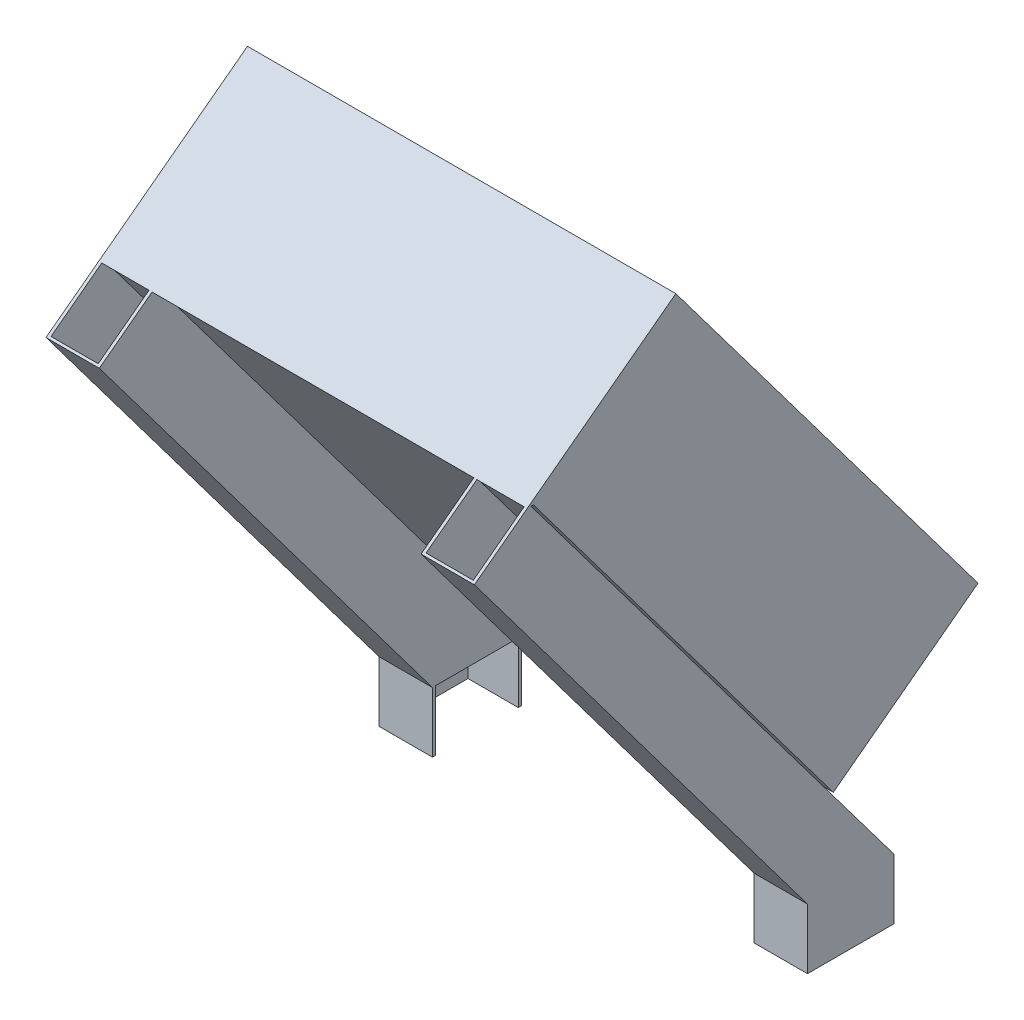
ISO-10303-21;
HEADER;
FILE_DESCRIPTION(('STEP AP214'),'2;1');
FILE_NAME('part.step','',(''),(''),'','','');
FILE_SCHEMA(('AUTOMOTIVE_DESIGN { 1 0 10303 214 1 1 1 1 }'));
ENDSEC;
DATA;
#1=APPLICATION_CONTEXT('core data for automotive mechanical design processes');
#2=APPLICATION_PROTOCOL_DEFINITION('international standard','automotive_design',2000,#1);
#3=PRODUCT_CONTEXT('',#1,'mechanical');
#4=PRODUCT('Part','Part','',(#3));
#5=PRODUCT_RELATED_PRODUCT_CATEGORY('part','',(#4));
#6=PRODUCT_DEFINITION_FORMATION('','',#4);
#7=PRODUCT_DEFINITION_CONTEXT('part definition',#1,'design');
#8=PRODUCT_DEFINITION('design','',#6,#7);
#9=PRODUCT_DEFINITION_SHAPE('','',#8);
#10=(LENGTH_UNIT() NAMED_UNIT(*) SI_UNIT(.MILLI.,.METRE.));
#11=(NAMED_UNIT(*) PLANE_ANGLE_UNIT() SI_UNIT($,.RADIAN.));
#12=(NAMED_UNIT(*) SI_UNIT($,.STERADIAN.) SOLID_ANGLE_UNIT());
#13=UNCERTAINTY_MEASURE_WITH_UNIT(LENGTH_MEASURE(1.E-05),#10,'distance_accuracy_value','');
#14=(GEOMETRIC_REPRESENTATION_CONTEXT(3) GLOBAL_UNCERTAINTY_ASSIGNED_CONTEXT((#13)) GLOBAL_UNIT_ASSIGNED_CONTEXT((#10,
#11,#12)) REPRESENTATION_CONTEXT('',''));
#15=CARTESIAN_POINT('',(0.,0.,0.));
#16=DIRECTION('',(0.,0.,1.));
#17=DIRECTION('',(1.,0.,0.));
#18=AXIS2_PLACEMENT_3D('',#15,#16,#17);
#19=CARTESIAN_POINT('',(0.,270.,0.));
#20=DIRECTION('',(0.,1.,0.));
#21=DIRECTION('',(0.,0.,1.));
#22=AXIS2_PLACEMENT_3D('',#19,#20,#21);
#23=PLANE('',#22);
#24=DIRECTION('',(0.,0.,1.));
#25=VECTOR('',#24,1.);
#26=CARTESIAN_POINT('',(80.,270.,180.457754729961));
#27=LINE('',#26,#25);
#28=CARTESIAN_POINT('',(80.,270.,138.957754729961));
#29=VERTEX_POINT('',#28);
#30=CARTESIAN_POINT('',(80.,270.,140.887720600899));
#31=VERTEX_POINT('',#30);
#32=EDGE_CURVE('E277',#29,#31,#27,.T.);
#33=ORIENTED_EDGE('',*,*,#32,.T.);
#34=DIRECTION('',(-1.,0.,0.));
#35=VECTOR('',#34,1.);
#36=CARTESIAN_POINT('',(0.,270.,140.887720600899));
#37=LINE('',#36,#35);
#38=CARTESIAN_POINT('',(-80.,270.,140.887720600899));
#39=VERTEX_POINT('',#38);
#40=EDGE_CURVE('E517',#31,#39,#37,.T.);
#41=ORIENTED_EDGE('',*,*,#40,.T.);
#42=DIRECTION('',(0.,0.,-1.));
#43=VECTOR('',#42,1.);
#44=CARTESIAN_POINT('',(-80.,270.,181.957754729961));
#45=LINE('',#44,#43);
#46=CARTESIAN_POINT('',(-80.,270.,137.764932895783));
#47=VERTEX_POINT('',#46);
#48=EDGE_CURVE('E360',#39,#47,#45,.T.);
#49=ORIENTED_EDGE('',*,*,#48,.T.);
#50=DIRECTION('',(-1.,0.,0.));
#51=VECTOR('',#50,1.);
#52=CARTESIAN_POINT('',(-106.5,270.,137.764932895783));
#53=LINE('',#52,#51);
#54=CARTESIAN_POINT('',(106.5,270.,137.764932895783));
#55=VERTEX_POINT('',#54);
#56=EDGE_CURVE('E339',#55,#47,#53,.T.);
#57=ORIENTED_EDGE('',*,*,#56,.F.);
#58=DIRECTION('',(0.,0.,-1.));
#59=VECTOR('',#58,1.);
#60=CARTESIAN_POINT('',(106.5,270.,137.764932895783));
#61=LINE('',#60,#59);
#62=CARTESIAN_POINT('',(106.5,270.,138.957754729961));
#63=VERTEX_POINT('',#62);
#64=EDGE_CURVE('E337',#63,#55,#61,.T.);
#65=ORIENTED_EDGE('',*,*,#64,.F.);
#66=DIRECTION('',(-1.,0.,0.));
#67=VECTOR('',#66,1.);
#68=CARTESIAN_POINT('',(106.5,270.,138.957754729961));
#69=LINE('',#68,#67);
#70=EDGE_CURVE('E275',#63,#29,#69,.T.);
#71=ORIENTED_EDGE('',*,*,#70,.T.);
#72=EDGE_LOOP('',(#33,#41,#49,#57,#65,#71));
#73=FACE_BOUND('',#72,.T.);
#74=ADVANCED_FACE('F39',(#73),#23,.F.);
#75=CARTESIAN_POINT('',(-80.,30.,0.));
#76=DIRECTION('',(0.,0.600975203281867,-0.79926766795631));
#77=DIRECTION('',(0.,0.79926766795631,0.600975203281867));
#78=AXIS2_PLACEMENT_3D('',#75,#76,#77);
#79=PLANE('',#78);
#80=DIRECTION('',(-1.,0.,0.));
#81=VECTOR('',#80,1.);
#82=CARTESIAN_POINT('',(-80.,250.992927858545,166.166198218973));
#83=LINE('',#82,#81);
#84=CARTESIAN_POINT('',(-81.5,250.992927858545,166.166198218973));
#85=VERTEX_POINT('',#84);
#86=CARTESIAN_POINT('',(-105.,250.992927858545,166.166198218973));
#87=VERTEX_POINT('',#86);
#88=EDGE_CURVE('E465',#85,#87,#83,.T.);
#89=ORIENTED_EDGE('',*,*,#88,.F.);
#90=DIRECTION('',(0.,-0.79926766795631,-0.600975203281867));
#91=VECTOR('',#90,1.);
#92=CARTESIAN_POINT('',(-81.5,30.,0.));
#93=LINE('',#92,#91);
#94=CARTESIAN_POINT('',(-81.5,30.,0.));
#95=VERTEX_POINT('',#94);
#96=EDGE_CURVE('E352',#85,#95,#93,.T.);
#97=ORIENTED_EDGE('',*,*,#96,.T.);
#98=DIRECTION('',(-1.,0.,0.));
#99=VECTOR('',#98,1.);
#100=CARTESIAN_POINT('',(0.,30.,0.));
#101=LINE('',#100,#99);
#102=CARTESIAN_POINT('',(-105.,30.,0.));
#103=VERTEX_POINT('',#102);
#104=EDGE_CURVE('E385',#95,#103,#101,.T.);
#105=ORIENTED_EDGE('',*,*,#104,.T.);
#106=DIRECTION('',(0.,0.79926766795631,0.600975203281867));
#107=VECTOR('',#106,1.);
#108=CARTESIAN_POINT('',(-105.,30.,0.));
#109=LINE('',#108,#107);
#110=EDGE_CURVE('E364',#103,#87,#109,.T.);
#111=ORIENTED_EDGE('',*,*,#110,.T.);
#112=EDGE_LOOP('',(#89,#97,#105,#111));
#113=FACE_BOUND('',#112,.T.);
#114=ADVANCED_FACE('F561',(#113),#79,.T.);
#115=CARTESIAN_POINT('',(-105.,30.,-41.1928218341787));
#116=DIRECTION('',(0.,-0.600975203281867,0.79926766795631));
#117=DIRECTION('',(0.,-0.79926766795631,-0.600975203281867));
#118=AXIS2_PLACEMENT_3D('',#115,#116,#117);
#119=PLANE('',#118);
#120=DIRECTION('',(-1.,0.,0.));
#121=VECTOR('',#120,1.);
#122=CARTESIAN_POINT('',(0.,30.,-41.1928218341787));
#123=LINE('',#122,#121);
#124=CARTESIAN_POINT('',(-81.5,30.,-41.1928218341787));
#125=VERTEX_POINT('',#124);
#126=CARTESIAN_POINT('',(-105.,30.,-41.1928218341787));
#127=VERTEX_POINT('',#126);
#128=EDGE_CURVE('E384',#125,#127,#123,.T.);
#129=ORIENTED_EDGE('',*,*,#128,.F.);
#130=DIRECTION('',(0.,0.79926766795631,0.600975203281867));
#131=VECTOR('',#130,1.);
#132=CARTESIAN_POINT('',(-81.5,30.,-41.1928218341787));
#133=LINE('',#132,#131);
#134=CARTESIAN_POINT('',(-81.5,270.,139.264932895783));
#135=VERTEX_POINT('',#134);
#136=EDGE_CURVE('E346',#125,#135,#133,.T.);
#137=ORIENTED_EDGE('',*,*,#136,.T.);
#138=DIRECTION('',(1.,0.,0.));
#139=VECTOR('',#138,1.);
#140=CARTESIAN_POINT('',(-105.,270.,139.264932895783));
#141=LINE('',#140,#139);
#142=CARTESIAN_POINT('',(-105.,270.,139.264932895783));
#143=VERTEX_POINT('',#142);
#144=EDGE_CURVE('E372',#143,#135,#141,.T.);
#145=ORIENTED_EDGE('',*,*,#144,.F.);
#146=DIRECTION('',(0.,0.79926766795631,0.600975203281867));
#147=VECTOR('',#146,1.);
#148=CARTESIAN_POINT('',(-105.,30.,-41.1928218341787));
#149=LINE('',#148,#147);
#150=EDGE_CURVE('E369',#127,#143,#149,.T.);
#151=ORIENTED_EDGE('',*,*,#150,.F.);
#152=EDGE_LOOP('',(#129,#137,#145,#151));
#153=FACE_BOUND('',#152,.T.);
#154=ADVANCED_FACE('F450',(#153),#119,.T.);
#155=CARTESIAN_POINT('',(0.,30.,0.));
#156=DIRECTION('',(0.,0.,1.));
#157=DIRECTION('',(1.,0.,0.));
#158=AXIS2_PLACEMENT_3D('',#155,#156,#157);
#159=PLANE('',#158);
#160=DIRECTION('',(-1.,0.,0.));
#161=VECTOR('',#160,1.);
#162=CARTESIAN_POINT('',(0.,0.,0.));
#163=LINE('',#162,#161);
#164=CARTESIAN_POINT('',(-80.,0.,0.));
#165=VERTEX_POINT('',#164);
#166=CARTESIAN_POINT('',(-105.,0.,0.));
#167=VERTEX_POINT('',#166);
#168=EDGE_CURVE('E397',#165,#167,#163,.T.);
#169=ORIENTED_EDGE('',*,*,#168,.T.);
#170=DIRECTION('',(0.,-1.,0.));
#171=VECTOR('',#170,1.);
#172=CARTESIAN_POINT('',(-105.,30.,0.));
#173=LINE('',#172,#171);
#174=EDGE_CURVE('E47',#103,#167,#173,.T.);
#175=ORIENTED_EDGE('',*,*,#174,.F.);
#176=ORIENTED_EDGE('',*,*,#104,.F.);
#177=CARTESIAN_POINT('',(-80.,30.,0.));
#178=VERTEX_POINT('',#177);
#179=EDGE_CURVE('E381',#178,#95,#101,.T.);
#180=ORIENTED_EDGE('',*,*,#179,.F.);
#181=DIRECTION('',(0.,-1.,0.));
#182=VECTOR('',#181,1.);
#183=CARTESIAN_POINT('',(-80.,30.,0.));
#184=LINE('',#183,#182);
#185=EDGE_CURVE('E11',#178,#165,#184,.T.);
#186=ORIENTED_EDGE('',*,*,#185,.T.);
#187=EDGE_LOOP('',(#169,#175,#176,#180,#186));
#188=FACE_BOUND('',#187,.T.);
#189=ADVANCED_FACE('F41',(#188),#159,.F.);
#190=CARTESIAN_POINT('',(-105.,30.,0.));
#191=DIRECTION('',(-1.,0.,0.));
#192=DIRECTION('',(0.,0.,1.));
#193=AXIS2_PLACEMENT_3D('',#190,#191,#192);
#194=PLANE('',#193);
#195=DIRECTION('',(0.,0.,-1.));
#196=VECTOR('',#195,1.);
#197=CARTESIAN_POINT('',(-105.,270.,180.457754729961));
#198=LINE('',#197,#196);
#199=CARTESIAN_POINT('',(-105.,270.,140.887720600899));
#200=VERTEX_POINT('',#199);
#201=EDGE_CURVE('E367',#200,#143,#198,.T.);
#202=ORIENTED_EDGE('',*,*,#201,.F.);
#203=DIRECTION('',(0.,-0.600975203281867,0.799267667956311));
#204=VECTOR('',#203,1.);
#205=CARTESIAN_POINT('',(-105.,250.992927858545,166.166198218973));
#206=LINE('',#205,#204);
#207=EDGE_CURVE('E54',#200,#87,#206,.T.);
#208=ORIENTED_EDGE('',*,*,#207,.T.);
#209=ORIENTED_EDGE('',*,*,#110,.F.);
#210=ORIENTED_EDGE('',*,*,#174,.T.);
#211=DIRECTION('',(0.,0.,-1.));
#212=VECTOR('',#211,1.);
#213=CARTESIAN_POINT('',(-105.,0.,0.));
#214=LINE('',#213,#212);
#215=CARTESIAN_POINT('',(-105.,0.,-41.1928218341787));
#216=VERTEX_POINT('',#215);
#217=EDGE_CURVE('E399',#167,#216,#214,.T.);
#218=ORIENTED_EDGE('',*,*,#217,.T.);
#219=DIRECTION('',(0.,-1.,0.));
#220=VECTOR('',#219,1.);
#221=CARTESIAN_POINT('',(-105.,30.,-41.1928218341787));
#222=LINE('',#221,#220);
#223=EDGE_CURVE('E426',#127,#216,#222,.T.);
#224=ORIENTED_EDGE('',*,*,#223,.F.);
#225=ORIENTED_EDGE('',*,*,#150,.T.);
#226=EDGE_LOOP('',(#202,#208,#209,#210,#218,#224,#225));
#227=FACE_BOUND('',#226,.T.);
#228=ADVANCED_FACE('F433',(#227),#194,.F.);
#229=CARTESIAN_POINT('',(0.,30.,-41.1928218341787));
#230=DIRECTION('',(0.,0.,1.));
#231=DIRECTION('',(1.,0.,0.));
#232=AXIS2_PLACEMENT_3D('',#229,#230,#231);
#233=PLANE('',#232);
#234=DIRECTION('',(-1.,0.,0.));
#235=VECTOR('',#234,1.);
#236=CARTESIAN_POINT('',(0.,0.,-41.1928218341787));
#237=LINE('',#236,#235);
#238=CARTESIAN_POINT('',(-80.,0.,-41.1928218341787));
#239=VERTEX_POINT('',#238);
#240=EDGE_CURVE('E402',#239,#216,#237,.T.);
#241=ORIENTED_EDGE('',*,*,#240,.F.);
#242=DIRECTION('',(0.,-1.,0.));
#243=VECTOR('',#242,1.);
#244=CARTESIAN_POINT('',(-80.,30.,-41.1928218341787));
#245=LINE('',#244,#243);
#246=CARTESIAN_POINT('',(-80.,30.,-41.1928218341787));
#247=VERTEX_POINT('',#246);
#248=EDGE_CURVE('E424',#247,#239,#245,.T.);
#249=ORIENTED_EDGE('',*,*,#248,.F.);
#250=EDGE_CURVE('E386',#247,#125,#123,.T.);
#251=ORIENTED_EDGE('',*,*,#250,.T.);
#252=ORIENTED_EDGE('',*,*,#128,.T.);
#253=ORIENTED_EDGE('',*,*,#223,.T.);
#254=EDGE_LOOP('',(#241,#249,#251,#252,#253));
#255=FACE_BOUND('',#254,.T.);
#256=ADVANCED_FACE('F445',(#255),#233,.T.);
#257=CARTESIAN_POINT('',(-80.,30.,0.));
#258=DIRECTION('',(1.,0.,0.));
#259=DIRECTION('',(0.,0.,-1.));
#260=AXIS2_PLACEMENT_3D('',#257,#258,#259);
#261=PLANE('',#260);
#262=DIRECTION('',(0.,0.600975203281867,-0.799267667956311));
#263=VECTOR('',#262,1.);
#264=CARTESIAN_POINT('',(-80.,250.992927858545,166.166198218973));
#265=LINE('',#264,#263);
#266=CARTESIAN_POINT('',(-80.,250.272417784705,167.124441426533));
#267=VERTEX_POINT('',#266);
#268=EDGE_CURVE('E460',#267,#39,#265,.T.);
#269=ORIENTED_EDGE('',*,*,#268,.F.);
#270=DIRECTION('',(0.,0.79926766795631,0.600975203281867));
#271=VECTOR('',#270,1.);
#272=CARTESIAN_POINT('',(-80.,30.,1.50000000000001));
#273=LINE('',#272,#271);
#274=CARTESIAN_POINT('',(-80.,30.,1.50000000000001));
#275=VERTEX_POINT('',#274);
#276=EDGE_CURVE('E357',#275,#267,#273,.T.);
#277=ORIENTED_EDGE('',*,*,#276,.F.);
#278=DIRECTION('',(0.,-1.,0.));
#279=VECTOR('',#278,1.);
#280=CARTESIAN_POINT('',(-80.,30.,1.50000000000001));
#281=LINE('',#280,#279);
#282=CARTESIAN_POINT('',(-80.,0.,1.50000000000001));
#283=VERTEX_POINT('',#282);
#284=EDGE_CURVE('E394',#275,#283,#281,.T.);
#285=ORIENTED_EDGE('',*,*,#284,.T.);
#286=DIRECTION('',(0.,0.,1.));
#287=VECTOR('',#286,1.);
#288=CARTESIAN_POINT('',(-80.,0.,0.));
#289=LINE('',#288,#287);
#290=EDGE_CURVE('E380',#165,#283,#289,.T.);
#291=ORIENTED_EDGE('',*,*,#290,.F.);
#292=ORIENTED_EDGE('',*,*,#185,.F.);
#293=DIRECTION('',(0.,0.,-1.));
#294=VECTOR('',#293,1.);
#295=CARTESIAN_POINT('',(-80.,30.,0.));
#296=LINE('',#295,#294);
#297=EDGE_CURVE('E342',#178,#247,#296,.T.);
#298=ORIENTED_EDGE('',*,*,#297,.T.);
#299=ORIENTED_EDGE('',*,*,#248,.T.);
#300=DIRECTION('',(0.,0.,1.));
#301=VECTOR('',#300,1.);
#302=CARTESIAN_POINT('',(-80.,0.,0.));
#303=LINE('',#302,#301);
#304=CARTESIAN_POINT('',(-80.,0.,-42.6928218341787));
#305=VERTEX_POINT('',#304);
#306=EDGE_CURVE('E405',#305,#239,#303,.T.);
#307=ORIENTED_EDGE('',*,*,#306,.F.);
#308=DIRECTION('',(0.,-1.,0.));
#309=VECTOR('',#308,1.);
#310=CARTESIAN_POINT('',(-80.,30.,-42.6928218341787));
#311=LINE('',#310,#309);
#312=CARTESIAN_POINT('',(-80.,30.,-42.6928218341787));
#313=VERTEX_POINT('',#312);
#314=EDGE_CURVE('E422',#313,#305,#311,.T.);
#315=ORIENTED_EDGE('',*,*,#314,.F.);
#316=DIRECTION('',(0.,0.79926766795631,0.600975203281867));
#317=VECTOR('',#316,1.);
#318=CARTESIAN_POINT('',(-80.,30.,-42.6928218341787));
#319=LINE('',#318,#317);
#320=CARTESIAN_POINT('',(-80.,71.6830830109224,-11.3510069576218));
#321=VERTEX_POINT('',#320);
#322=EDGE_CURVE('E375',#313,#321,#319,.T.);
#323=ORIENTED_EDGE('',*,*,#322,.T.);
#324=DIRECTION('',(0.,-0.79926766795631,-0.600975203281867));
#325=VECTOR('',#324,1.);
#326=CARTESIAN_POINT('',(-80.,50.5070721414547,-27.2734043561276));
#327=LINE('',#326,#325);
#328=EDGE_CURVE('E473',#47,#321,#327,.T.);
#329=ORIENTED_EDGE('',*,*,#328,.F.);
#330=ORIENTED_EDGE('',*,*,#48,.F.);
#331=EDGE_LOOP('',(#269,#277,#285,#291,#292,#298,#299,#307,#315,#323,#329,#330));
#332=FACE_BOUND('',#331,.T.);
#333=ADVANCED_FACE('F532',(#332),#261,.T.);
#334=CARTESIAN_POINT('',(0.,30.,-42.6928218341787));
#335=DIRECTION('',(0.,0.,1.));
#336=DIRECTION('',(1.,0.,0.));
#337=AXIS2_PLACEMENT_3D('',#334,#335,#336);
#338=PLANE('',#337);
#339=DIRECTION('',(-1.,0.,0.));
#340=VECTOR('',#339,1.);
#341=CARTESIAN_POINT('',(0.,0.,-42.6928218341787));
#342=LINE('',#341,#340);
#343=CARTESIAN_POINT('',(-106.5,0.,-42.6928218341787));
#344=VERTEX_POINT('',#343);
#345=EDGE_CURVE('E408',#305,#344,#342,.T.);
#346=ORIENTED_EDGE('',*,*,#345,.T.);
#347=DIRECTION('',(0.,-1.,0.));
#348=VECTOR('',#347,1.);
#349=CARTESIAN_POINT('',(-106.5,30.,-42.6928218341787));
#350=LINE('',#349,#348);
#351=CARTESIAN_POINT('',(-106.5,30.,-42.6928218341787));
#352=VERTEX_POINT('',#351);
#353=EDGE_CURVE('E420',#352,#344,#350,.T.);
#354=ORIENTED_EDGE('',*,*,#353,.F.);
#355=DIRECTION('',(-1.,0.,0.));
#356=VECTOR('',#355,1.);
#357=CARTESIAN_POINT('',(0.,30.,-42.6928218341787));
#358=LINE('',#357,#356);
#359=EDGE_CURVE('E389',#313,#352,#358,.T.);
#360=ORIENTED_EDGE('',*,*,#359,.F.);
#361=ORIENTED_EDGE('',*,*,#314,.T.);
#362=EDGE_LOOP('',(#346,#354,#360,#361));
#363=FACE_BOUND('',#362,.T.);
#364=ADVANCED_FACE('F549',(#363),#338,.F.);
#365=CARTESIAN_POINT('',(-106.5,30.,0.));
#366=DIRECTION('',(-1.,0.,0.));
#367=DIRECTION('',(0.,0.,1.));
#368=AXIS2_PLACEMENT_3D('',#365,#366,#367);
#369=PLANE('',#368);
#370=DIRECTION('',(0.,0.79926766795631,0.600975203281867));
#371=VECTOR('',#370,1.);
#372=CARTESIAN_POINT('',(-106.5,30.,1.50000000000001));
#373=LINE('',#372,#371);
#374=CARTESIAN_POINT('',(-106.5,30.,1.50000000000001));
#375=VERTEX_POINT('',#374);
#376=CARTESIAN_POINT('',(-106.5,250.272417784705,167.124441426533));
#377=VERTEX_POINT('',#376);
#378=EDGE_CURVE('E354',#375,#377,#373,.T.);
#379=ORIENTED_EDGE('',*,*,#378,.T.);
#380=DIRECTION('',(0.,0.600975203281868,-0.79926766795631));
#381=VECTOR('',#380,1.);
#382=CARTESIAN_POINT('',(-106.5,271.5,138.892793862845));
#383=LINE('',#382,#381);
#384=CARTESIAN_POINT('',(-106.5,325.587768295368,66.958703746777));
#385=VERTEX_POINT('',#384);
#386=EDGE_CURVE('E466',#377,#385,#383,.T.);
#387=ORIENTED_EDGE('',*,*,#386,.T.);
#388=DIRECTION('',(0.,-0.799267667956311,-0.600975203281867));
#389=VECTOR('',#388,1.);
#390=CARTESIAN_POINT('',(-106.5,325.587768295368,66.958703746777));
#391=LINE('',#390,#389);
#392=CARTESIAN_POINT('',(-106.5,125.77085130629,-83.2850970736897));
#393=VERTEX_POINT('',#392);
#394=EDGE_CURVE('E476',#385,#393,#391,.T.);
#395=ORIENTED_EDGE('',*,*,#394,.T.);
#396=DIRECTION('',(0.,-0.600975203281867,0.79926766795631));
#397=VECTOR('',#396,1.);
#398=CARTESIAN_POINT('',(-106.5,125.77085130629,-83.2850970736897));
#399=LINE('',#398,#397);
#400=CARTESIAN_POINT('',(-106.5,71.6830830109224,-11.3510069576218));
#401=VERTEX_POINT('',#400);
#402=EDGE_CURVE('E479',#393,#401,#399,.T.);
#403=ORIENTED_EDGE('',*,*,#402,.T.);
#404=DIRECTION('',(0.,0.79926766795631,0.600975203281867));
#405=VECTOR('',#404,1.);
#406=CARTESIAN_POINT('',(-106.5,30.,-42.6928218341787));
#407=LINE('',#406,#405);
#408=EDGE_CURVE('E378',#352,#401,#407,.T.);
#409=ORIENTED_EDGE('',*,*,#408,.F.);
#410=ORIENTED_EDGE('',*,*,#353,.T.);
#411=DIRECTION('',(0.,0.,-1.));
#412=VECTOR('',#411,1.);
#413=CARTESIAN_POINT('',(-106.5,0.,0.));
#414=LINE('',#413,#412);
#415=CARTESIAN_POINT('',(-106.5,0.,1.50000000000001));
#416=VERTEX_POINT('',#415);
#417=EDGE_CURVE('E411',#416,#344,#414,.T.);
#418=ORIENTED_EDGE('',*,*,#417,.F.);
#419=DIRECTION('',(0.,-1.,0.));
#420=VECTOR('',#419,1.);
#421=CARTESIAN_POINT('',(-106.5,30.,1.50000000000001));
#422=LINE('',#421,#420);
#423=EDGE_CURVE('E418',#375,#416,#422,.T.);
#424=ORIENTED_EDGE('',*,*,#423,.F.);
#425=EDGE_LOOP('',(#379,#387,#395,#403,#409,#410,#418,#424));
#426=FACE_BOUND('',#425,.T.);
#427=ADVANCED_FACE('F544',(#426),#369,.T.);
#428=CARTESIAN_POINT('',(0.,30.,1.50000000000001));
#429=DIRECTION('',(0.,0.,1.));
#430=DIRECTION('',(1.,0.,0.));
#431=AXIS2_PLACEMENT_3D('',#428,#429,#430);
#432=PLANE('',#431);
#433=DIRECTION('',(-1.,0.,0.));
#434=VECTOR('',#433,1.);
#435=CARTESIAN_POINT('',(0.,0.,1.50000000000001));
#436=LINE('',#435,#434);
#437=EDGE_CURVE('E414',#283,#416,#436,.T.);
#438=ORIENTED_EDGE('',*,*,#437,.F.);
#439=ORIENTED_EDGE('',*,*,#284,.F.);
#440=DIRECTION('',(-1.,0.,0.));
#441=VECTOR('',#440,1.);
#442=CARTESIAN_POINT('',(0.,30.,1.50000000000001));
#443=LINE('',#442,#441);
#444=EDGE_CURVE('E391',#275,#375,#443,.T.);
#445=ORIENTED_EDGE('',*,*,#444,.T.);
#446=ORIENTED_EDGE('',*,*,#423,.T.);
#447=EDGE_LOOP('',(#438,#439,#445,#446));
#448=FACE_BOUND('',#447,.T.);
#449=ADVANCED_FACE('F540',(#448),#432,.T.);
#450=CARTESIAN_POINT('',(0.,0.,0.));
#451=DIRECTION('',(0.,1.,0.));
#452=DIRECTION('',(0.,0.,1.));
#453=AXIS2_PLACEMENT_3D('',#450,#451,#452);
#454=PLANE('',#453);
#455=ORIENTED_EDGE('',*,*,#290,.T.);
#456=ORIENTED_EDGE('',*,*,#437,.T.);
#457=ORIENTED_EDGE('',*,*,#417,.T.);
#458=ORIENTED_EDGE('',*,*,#345,.F.);
#459=ORIENTED_EDGE('',*,*,#306,.T.);
#460=ORIENTED_EDGE('',*,*,#240,.T.);
#461=ORIENTED_EDGE('',*,*,#217,.F.);
#462=ORIENTED_EDGE('',*,*,#168,.F.);
#463=EDGE_LOOP('',(#455,#456,#457,#458,#459,#460,#461,#462));
#464=FACE_BOUND('',#463,.T.);
#465=ADVANCED_FACE('F439',(#464),#454,.F.);
#466=CARTESIAN_POINT('',(-106.5,30.,1.50000000000001));
#467=DIRECTION('',(0.,-0.600975203281867,0.79926766795631));
#468=DIRECTION('',(0.,-0.79926766795631,-0.600975203281867));
#469=AXIS2_PLACEMENT_3D('',#466,#467,#468);
#470=PLANE('',#469);
#471=DIRECTION('',(1.,0.,0.));
#472=VECTOR('',#471,1.);
#473=CARTESIAN_POINT('',(-106.5,250.272417784705,167.124441426533));
#474=LINE('',#473,#472);
#475=EDGE_CURVE('E457',#377,#267,#474,.T.);
#476=ORIENTED_EDGE('',*,*,#475,.F.);
#477=ORIENTED_EDGE('',*,*,#378,.F.);
#478=ORIENTED_EDGE('',*,*,#444,.F.);
#479=ORIENTED_EDGE('',*,*,#276,.T.);
#480=EDGE_LOOP('',(#476,#477,#478,#479));
#481=FACE_BOUND('',#480,.T.);
#482=ADVANCED_FACE('F536',(#481),#470,.T.);
#483=CARTESIAN_POINT('',(-80.,30.,-42.6928218341787));
#484=DIRECTION('',(0.,0.600975203281867,-0.79926766795631));
#485=DIRECTION('',(0.,0.79926766795631,0.600975203281867));
#486=AXIS2_PLACEMENT_3D('',#483,#484,#485);
#487=PLANE('',#486);
#488=DIRECTION('',(-1.,0.,0.));
#489=VECTOR('',#488,1.);
#490=CARTESIAN_POINT('',(443.887913877187,71.6830830109224,-11.3510069576218));
#491=LINE('',#490,#489);
#492=EDGE_CURVE('E485',#321,#401,#491,.T.);
#493=ORIENTED_EDGE('',*,*,#492,.F.);
#494=ORIENTED_EDGE('',*,*,#322,.F.);
#495=ORIENTED_EDGE('',*,*,#359,.T.);
#496=ORIENTED_EDGE('',*,*,#408,.T.);
#497=EDGE_LOOP('',(#493,#494,#495,#496));
#498=FACE_BOUND('',#497,.T.);
#499=ADVANCED_FACE('F597',(#498),#487,.T.);
#500=CARTESIAN_POINT('',(-81.5,30.,0.));
#501=DIRECTION('',(0.,-1.,0.));
#502=DIRECTION('',(0.,0.,-1.));
#503=AXIS2_PLACEMENT_3D('',#500,#501,#502);
#504=PLANE('',#503);
#505=ORIENTED_EDGE('',*,*,#297,.F.);
#506=ORIENTED_EDGE('',*,*,#179,.T.);
#507=DIRECTION('',(0.,0.,-1.));
#508=VECTOR('',#507,1.);
#509=CARTESIAN_POINT('',(-81.5,30.,0.));
#510=LINE('',#509,#508);
#511=EDGE_CURVE('E343',#95,#125,#510,.T.);
#512=ORIENTED_EDGE('',*,*,#511,.T.);
#513=ORIENTED_EDGE('',*,*,#250,.F.);
#514=EDGE_LOOP('',(#505,#506,#512,#513));
#515=FACE_BOUND('',#514,.T.);
#516=ADVANCED_FACE('F553',(#515),#504,.T.);
#517=CARTESIAN_POINT('',(-81.5,0.,0.));
#518=DIRECTION('',(1.,0.,0.));
#519=DIRECTION('',(0.,0.,-1.));
#520=AXIS2_PLACEMENT_3D('',#517,#518,#519);
#521=PLANE('',#520);
#522=ORIENTED_EDGE('',*,*,#96,.F.);
#523=DIRECTION('',(0.,0.600975203281867,-0.799267667956311));
#524=VECTOR('',#523,1.);
#525=CARTESIAN_POINT('',(-81.5,240.157792009755,180.576399695773));
#526=LINE('',#525,#524);
#527=CARTESIAN_POINT('',(-81.5,270.,140.887720600899));
#528=VERTEX_POINT('',#527);
#529=EDGE_CURVE('E456',#85,#528,#526,.T.);
#530=ORIENTED_EDGE('',*,*,#529,.T.);
#531=DIRECTION('',(0.,0.,1.));
#532=VECTOR('',#531,1.);
#533=CARTESIAN_POINT('',(-81.5,270.,180.457754729961));
#534=LINE('',#533,#532);
#535=EDGE_CURVE('E349',#135,#528,#534,.T.);
#536=ORIENTED_EDGE('',*,*,#535,.F.);
#537=ORIENTED_EDGE('',*,*,#136,.F.);
#538=ORIENTED_EDGE('',*,*,#511,.F.);
#539=EDGE_LOOP('',(#522,#530,#536,#537,#538));
#540=FACE_BOUND('',#539,.T.);
#541=ADVANCED_FACE('F557',(#540),#521,.F.);
#542=CARTESIAN_POINT('',(106.5,271.5,137.764932895783));
#543=DIRECTION('',(-1.,0.,0.));
#544=DIRECTION('',(0.,0.,1.));
#545=AXIS2_PLACEMENT_3D('',#542,#543,#544);
#546=PLANE('',#545);
#547=DIRECTION('',(0.,-0.600975203281868,0.79926766795631));
#548=VECTOR('',#547,1.);
#549=CARTESIAN_POINT('',(106.5,271.5,138.892793862845));
#550=LINE('',#549,#548);
#551=CARTESIAN_POINT('',(106.5,325.587768295368,66.958703746777));
#552=VERTEX_POINT('',#551);
#553=CARTESIAN_POINT('',(106.5,250.272417784705,167.124441426533));
#554=VERTEX_POINT('',#553);
#555=EDGE_CURVE('E251',#552,#554,#550,.T.);
#556=ORIENTED_EDGE('',*,*,#555,.T.);
#557=DIRECTION('',(0.,0.79926766795631,0.600975203281867));
#558=VECTOR('',#557,1.);
#559=CARTESIAN_POINT('',(106.5,30.,1.5));
#560=LINE('',#559,#558);
#561=CARTESIAN_POINT('',(106.5,30.,1.5));
#562=VERTEX_POINT('',#561);
#563=EDGE_CURVE('E255',#562,#554,#560,.T.);
#564=ORIENTED_EDGE('',*,*,#563,.F.);
#565=DIRECTION('',(0.,-1.,0.));
#566=VECTOR('',#565,1.);
#567=CARTESIAN_POINT('',(106.5,30.,1.5));
#568=LINE('',#567,#566);
#569=CARTESIAN_POINT('',(106.5,0.,1.5));
#570=VERTEX_POINT('',#569);
#571=EDGE_CURVE('E330',#562,#570,#568,.T.);
#572=ORIENTED_EDGE('',*,*,#571,.T.);
#573=DIRECTION('',(0.,0.,-1.));
#574=VECTOR('',#573,1.);
#575=CARTESIAN_POINT('',(106.5,0.,0.));
#576=LINE('',#575,#574);
#577=CARTESIAN_POINT('',(106.5,0.,-41.5));
#578=VERTEX_POINT('',#577);
#579=EDGE_CURVE('E306',#570,#578,#576,.T.);
#580=ORIENTED_EDGE('',*,*,#579,.T.);
#581=DIRECTION('',(0.,-1.,0.));
#582=VECTOR('',#581,1.);
#583=CARTESIAN_POINT('',(106.5,30.,-41.5));
#584=LINE('',#583,#582);
#585=CARTESIAN_POINT('',(106.5,30.,-41.5));
#586=VERTEX_POINT('',#585);
#587=EDGE_CURVE('E328',#586,#578,#584,.T.);
#588=ORIENTED_EDGE('',*,*,#587,.F.);
#589=DIRECTION('',(0.,0.79926766795631,0.600975203281867));
#590=VECTOR('',#589,1.);
#591=CARTESIAN_POINT('',(106.5,30.,-41.5));
#592=LINE('',#591,#590);
#593=EDGE_CURVE('E271',#586,#63,#592,.T.);
#594=ORIENTED_EDGE('',*,*,#593,.T.);
#595=ORIENTED_EDGE('',*,*,#64,.T.);
#596=DIRECTION('',(0.,-0.79926766795631,-0.600975203281867));
#597=VECTOR('',#596,1.);
#598=CARTESIAN_POINT('',(106.5,71.6830830109224,-11.3510069576218));
#599=LINE('',#598,#597);
#600=CARTESIAN_POINT('',(106.5,71.6830830109224,-11.3510069576218));
#601=VERTEX_POINT('',#600);
#602=EDGE_CURVE('E471',#55,#601,#599,.T.);
#603=ORIENTED_EDGE('',*,*,#602,.T.);
#604=DIRECTION('',(0.,0.600975203281867,-0.79926766795631));
#605=VECTOR('',#604,1.);
#606=CARTESIAN_POINT('',(106.5,125.77085130629,-83.2850970736897));
#607=LINE('',#606,#605);
#608=CARTESIAN_POINT('',(106.5,125.77085130629,-83.2850970736897));
#609=VERTEX_POINT('',#608);
#610=EDGE_CURVE('E469',#601,#609,#607,.T.);
#611=ORIENTED_EDGE('',*,*,#610,.T.);
#612=DIRECTION('',(0.,0.799267667956311,0.600975203281867));
#613=VECTOR('',#612,1.);
#614=CARTESIAN_POINT('',(106.5,325.587768295368,66.958703746777));
#615=LINE('',#614,#613);
#616=EDGE_CURVE('E258',#609,#552,#615,.T.);
#617=ORIENTED_EDGE('',*,*,#616,.T.);
#618=EDGE_LOOP('',(#556,#564,#572,#580,#588,#594,#595,#603,#611,#617));
#619=FACE_BOUND('',#618,.T.);
#620=ADVANCED_FACE('F252',(#619),#546,.F.);
#621=ORIENTED_EDGE('',*,*,#535,.T.);
#622=DIRECTION('',(-1.,0.,0.));
#623=VECTOR('',#622,1.);
#624=CARTESIAN_POINT('',(0.,270.,140.887720600899));
#625=LINE('',#624,#623);
#626=EDGE_CURVE('E454',#528,#200,#625,.T.);
#627=ORIENTED_EDGE('',*,*,#626,.T.);
#628=ORIENTED_EDGE('',*,*,#201,.T.);
#629=ORIENTED_EDGE('',*,*,#144,.T.);
#630=EDGE_LOOP('',(#621,#627,#628,#629));
#631=FACE_BOUND('',#630,.T.);
#632=ADVANCED_FACE('F453',(#631),#23,.F.);
#633=CARTESIAN_POINT('',(105.,30.,0.));
#634=DIRECTION('',(0.,0.600975203281867,-0.79926766795631));
#635=DIRECTION('',(0.,0.79926766795631,0.600975203281867));
#636=AXIS2_PLACEMENT_3D('',#633,#634,#635);
#637=PLANE('',#636);
#638=DIRECTION('',(-1.,0.,0.));
#639=VECTOR('',#638,1.);
#640=CARTESIAN_POINT('',(105.,250.992927858545,166.166198218973));
#641=LINE('',#640,#639);
#642=CARTESIAN_POINT('',(105.,250.992927858545,166.166198218973));
#643=VERTEX_POINT('',#642);
#644=CARTESIAN_POINT('',(81.5,250.992927858545,166.166198218973));
#645=VERTEX_POINT('',#644);
#646=EDGE_CURVE('E266',#643,#645,#641,.T.);
#647=ORIENTED_EDGE('',*,*,#646,.F.);
#648=DIRECTION('',(0.,0.79926766795631,0.600975203281867));
#649=VECTOR('',#648,1.);
#650=CARTESIAN_POINT('',(105.,30.,0.));
#651=LINE('',#650,#649);
#652=CARTESIAN_POINT('',(105.,30.,0.));
#653=VERTEX_POINT('',#652);
#654=EDGE_CURVE('E509',#653,#643,#651,.T.);
#655=ORIENTED_EDGE('',*,*,#654,.F.);
#656=DIRECTION('',(1.,0.,0.));
#657=VECTOR('',#656,1.);
#658=CARTESIAN_POINT('',(0.,30.,0.));
#659=LINE('',#658,#657);
#660=CARTESIAN_POINT('',(81.5,30.,0.));
#661=VERTEX_POINT('',#660);
#662=EDGE_CURVE('E291',#661,#653,#659,.T.);
#663=ORIENTED_EDGE('',*,*,#662,.F.);
#664=DIRECTION('',(0.,0.79926766795631,0.600975203281867));
#665=VECTOR('',#664,1.);
#666=CARTESIAN_POINT('',(81.5,30.,0.));
#667=LINE('',#666,#665);
#668=EDGE_CURVE('E495',#661,#645,#667,.T.);
#669=ORIENTED_EDGE('',*,*,#668,.T.);
#670=EDGE_LOOP('',(#647,#655,#663,#669));
#671=FACE_BOUND('',#670,.T.);
#672=ADVANCED_FACE('F582',(#671),#637,.T.);
#673=CARTESIAN_POINT('',(80.,30.,-40.));
#674=DIRECTION('',(0.,-0.600975203281867,0.79926766795631));
#675=DIRECTION('',(0.,-0.79926766795631,-0.600975203281867));
#676=AXIS2_PLACEMENT_3D('',#673,#674,#675);
#677=PLANE('',#676);
#678=DIRECTION('',(1.,0.,0.));
#679=VECTOR('',#678,1.);
#680=CARTESIAN_POINT('',(80.,270.,140.457754729961));
#681=LINE('',#680,#679);
#682=CARTESIAN_POINT('',(81.5,270.,140.457754729961));
#683=VERTEX_POINT('',#682);
#684=CARTESIAN_POINT('',(105.,270.,140.457754729961));
#685=VERTEX_POINT('',#684);
#686=EDGE_CURVE('E285',#683,#685,#681,.T.);
#687=ORIENTED_EDGE('',*,*,#686,.F.);
#688=DIRECTION('',(0.,-0.79926766795631,-0.600975203281867));
#689=VECTOR('',#688,1.);
#690=CARTESIAN_POINT('',(81.5,30.,-40.));
#691=LINE('',#690,#689);
#692=CARTESIAN_POINT('',(81.5,30.,-40.));
#693=VERTEX_POINT('',#692);
#694=EDGE_CURVE('E500',#683,#693,#691,.T.);
#695=ORIENTED_EDGE('',*,*,#694,.T.);
#696=DIRECTION('',(1.,0.,0.));
#697=VECTOR('',#696,1.);
#698=CARTESIAN_POINT('',(0.,30.,-40.));
#699=LINE('',#698,#697);
#700=CARTESIAN_POINT('',(105.,30.,-40.));
#701=VERTEX_POINT('',#700);
#702=EDGE_CURVE('E296',#693,#701,#699,.T.);
#703=ORIENTED_EDGE('',*,*,#702,.T.);
#704=DIRECTION('',(0.,0.79926766795631,0.600975203281867));
#705=VECTOR('',#704,1.);
#706=CARTESIAN_POINT('',(105.,30.,-40.));
#707=LINE('',#706,#705);
#708=EDGE_CURVE('E503',#701,#685,#707,.T.);
#709=ORIENTED_EDGE('',*,*,#708,.T.);
#710=EDGE_LOOP('',(#687,#695,#703,#709));
#711=FACE_BOUND('',#710,.T.);
#712=ADVANCED_FACE('F587',(#711),#677,.T.);
#713=CARTESIAN_POINT('',(0.,30.,0.));
#714=DIRECTION('',(0.,0.,-1.));
#715=DIRECTION('',(-1.,0.,0.));
#716=AXIS2_PLACEMENT_3D('',#713,#714,#715);
#717=PLANE('',#716);
#718=DIRECTION('',(1.,0.,0.));
#719=VECTOR('',#718,1.);
#720=CARTESIAN_POINT('',(0.,0.,0.));
#721=LINE('',#720,#719);
#722=CARTESIAN_POINT('',(80.,0.,0.));
#723=VERTEX_POINT('',#722);
#724=CARTESIAN_POINT('',(105.,0.,0.));
#725=VERTEX_POINT('',#724);
#726=EDGE_CURVE('E287',#723,#725,#721,.T.);
#727=ORIENTED_EDGE('',*,*,#726,.F.);
#728=DIRECTION('',(0.,-1.,0.));
#729=VECTOR('',#728,1.);
#730=CARTESIAN_POINT('',(80.,30.,0.));
#731=LINE('',#730,#729);
#732=CARTESIAN_POINT('',(80.,30.,0.));
#733=VERTEX_POINT('',#732);
#734=EDGE_CURVE('E335',#733,#723,#731,.T.);
#735=ORIENTED_EDGE('',*,*,#734,.F.);
#736=EDGE_CURVE('E288',#733,#661,#659,.T.);
#737=ORIENTED_EDGE('',*,*,#736,.T.);
#738=ORIENTED_EDGE('',*,*,#662,.T.);
#739=DIRECTION('',(0.,-1.,0.));
#740=VECTOR('',#739,1.);
#741=CARTESIAN_POINT('',(105.,30.,0.));
#742=LINE('',#741,#740);
#743=EDGE_CURVE('E299',#653,#725,#742,.T.);
#744=ORIENTED_EDGE('',*,*,#743,.T.);
#745=EDGE_LOOP('',(#727,#735,#737,#738,#744));
#746=FACE_BOUND('',#745,.T.);
#747=ADVANCED_FACE('F782',(#746),#717,.T.);
#748=CARTESIAN_POINT('',(0.,30.,1.5));
#749=DIRECTION('',(0.,0.,-1.));
#750=DIRECTION('',(-1.,0.,0.));
#751=AXIS2_PLACEMENT_3D('',#748,#749,#750);
#752=PLANE('',#751);
#753=DIRECTION('',(1.,0.,0.));
#754=VECTOR('',#753,1.);
#755=CARTESIAN_POINT('',(0.,0.,1.5));
#756=LINE('',#755,#754);
#757=CARTESIAN_POINT('',(80.,0.,1.5));
#758=VERTEX_POINT('',#757);
#759=EDGE_CURVE('E304',#758,#570,#756,.T.);
#760=ORIENTED_EDGE('',*,*,#759,.T.);
#761=ORIENTED_EDGE('',*,*,#571,.F.);
#762=DIRECTION('',(1.,0.,0.));
#763=VECTOR('',#762,1.);
#764=CARTESIAN_POINT('',(0.,30.,1.5));
#765=LINE('',#764,#763);
#766=CARTESIAN_POINT('',(80.,30.,1.5));
#767=VERTEX_POINT('',#766);
#768=EDGE_CURVE('E270',#767,#562,#765,.T.);
#769=ORIENTED_EDGE('',*,*,#768,.F.);
#770=DIRECTION('',(0.,-1.,0.));
#771=VECTOR('',#770,1.);
#772=CARTESIAN_POINT('',(80.,30.,1.5));
#773=LINE('',#772,#771);
#774=EDGE_CURVE('E332',#767,#758,#773,.T.);
#775=ORIENTED_EDGE('',*,*,#774,.T.);
#776=EDGE_LOOP('',(#760,#761,#769,#775));
#777=FACE_BOUND('',#776,.T.);
#778=ADVANCED_FACE('F789',(#777),#752,.F.);
#779=CARTESIAN_POINT('',(0.,30.,-41.5));
#780=DIRECTION('',(0.,0.,-1.));
#781=DIRECTION('',(-1.,0.,0.));
#782=AXIS2_PLACEMENT_3D('',#779,#780,#781);
#783=PLANE('',#782);
#784=DIRECTION('',(1.,0.,0.));
#785=VECTOR('',#784,1.);
#786=CARTESIAN_POINT('',(0.,0.,-41.5));
#787=LINE('',#786,#785);
#788=CARTESIAN_POINT('',(80.,0.,-41.5));
#789=VERTEX_POINT('',#788);
#790=EDGE_CURVE('E309',#789,#578,#787,.T.);
#791=ORIENTED_EDGE('',*,*,#790,.F.);
#792=DIRECTION('',(0.,-1.,0.));
#793=VECTOR('',#792,1.);
#794=CARTESIAN_POINT('',(80.,30.,-41.5));
#795=LINE('',#794,#793);
#796=CARTESIAN_POINT('',(80.,30.,-41.5));
#797=VERTEX_POINT('',#796);
#798=EDGE_CURVE('E326',#797,#789,#795,.T.);
#799=ORIENTED_EDGE('',*,*,#798,.F.);
#800=DIRECTION('',(1.,0.,0.));
#801=VECTOR('',#800,1.);
#802=CARTESIAN_POINT('',(0.,30.,-41.5));
#803=LINE('',#802,#801);
#804=EDGE_CURVE('E293',#797,#586,#803,.T.);
#805=ORIENTED_EDGE('',*,*,#804,.T.);
#806=ORIENTED_EDGE('',*,*,#587,.T.);
#807=EDGE_LOOP('',(#791,#799,#805,#806));
#808=FACE_BOUND('',#807,.T.);
#809=ADVANCED_FACE('F686',(#808),#783,.T.);
#810=CARTESIAN_POINT('',(80.,30.,0.));
#811=DIRECTION('',(1.,0.,0.));
#812=DIRECTION('',(0.,0.,-1.));
#813=AXIS2_PLACEMENT_3D('',#810,#811,#812);
#814=PLANE('',#813);
#815=DIRECTION('',(0.,0.79926766795631,0.600975203281867));
#816=VECTOR('',#815,1.);
#817=CARTESIAN_POINT('',(80.,30.,1.5));
#818=LINE('',#817,#816);
#819=CARTESIAN_POINT('',(80.,250.272417784705,167.124441426533));
#820=VERTEX_POINT('',#819);
#821=EDGE_CURVE('E272',#767,#820,#818,.T.);
#822=ORIENTED_EDGE('',*,*,#821,.T.);
#823=DIRECTION('',(0.,0.600975203281867,-0.799267667956311));
#824=VECTOR('',#823,1.);
#825=CARTESIAN_POINT('',(80.,250.992927858545,166.166198218973));
#826=LINE('',#825,#824);
#827=EDGE_CURVE('E62',#820,#31,#826,.T.);
#828=ORIENTED_EDGE('',*,*,#827,.T.);
#829=ORIENTED_EDGE('',*,*,#32,.F.);
#830=DIRECTION('',(0.,0.79926766795631,0.600975203281867));
#831=VECTOR('',#830,1.);
#832=CARTESIAN_POINT('',(80.,30.,-41.5));
#833=LINE('',#832,#831);
#834=EDGE_CURVE('E283',#797,#29,#833,.T.);
#835=ORIENTED_EDGE('',*,*,#834,.F.);
#836=ORIENTED_EDGE('',*,*,#798,.T.);
#837=DIRECTION('',(0.,0.,1.));
#838=VECTOR('',#837,1.);
#839=CARTESIAN_POINT('',(80.,0.,0.));
#840=LINE('',#839,#838);
#841=CARTESIAN_POINT('',(80.,0.,-40.));
#842=VERTEX_POINT('',#841);
#843=EDGE_CURVE('E312',#789,#842,#840,.T.);
#844=ORIENTED_EDGE('',*,*,#843,.T.);
#845=DIRECTION('',(0.,-1.,0.));
#846=VECTOR('',#845,1.);
#847=CARTESIAN_POINT('',(80.,30.,-40.));
#848=LINE('',#847,#846);
#849=CARTESIAN_POINT('',(80.,30.,-40.));
#850=VERTEX_POINT('',#849);
#851=EDGE_CURVE('E323',#850,#842,#848,.T.);
#852=ORIENTED_EDGE('',*,*,#851,.F.);
#853=DIRECTION('',(0.,0.,1.));
#854=VECTOR('',#853,1.);
#855=CARTESIAN_POINT('',(80.,30.,-40.));
#856=LINE('',#855,#854);
#857=EDGE_CURVE('E491',#850,#733,#856,.T.);
#858=ORIENTED_EDGE('',*,*,#857,.T.);
#859=ORIENTED_EDGE('',*,*,#734,.T.);
#860=DIRECTION('',(0.,0.,1.));
#861=VECTOR('',#860,1.);
#862=CARTESIAN_POINT('',(80.,0.,0.));
#863=LINE('',#862,#861);
#864=EDGE_CURVE('E302',#723,#758,#863,.T.);
#865=ORIENTED_EDGE('',*,*,#864,.T.);
#866=ORIENTED_EDGE('',*,*,#774,.F.);
#867=EDGE_LOOP('',(#822,#828,#829,#835,#836,#844,#852,#858,#859,#865,#866));
#868=FACE_BOUND('',#867,.T.);
#869=ADVANCED_FACE('F522',(#868),#814,.F.);
#870=CARTESIAN_POINT('',(0.,30.,-40.));
#871=DIRECTION('',(0.,0.,-1.));
#872=DIRECTION('',(-1.,0.,0.));
#873=AXIS2_PLACEMENT_3D('',#870,#871,#872);
#874=PLANE('',#873);
#875=DIRECTION('',(1.,0.,0.));
#876=VECTOR('',#875,1.);
#877=CARTESIAN_POINT('',(0.,0.,-40.));
#878=LINE('',#877,#876);
#879=CARTESIAN_POINT('',(105.,0.,-40.));
#880=VERTEX_POINT('',#879);
#881=EDGE_CURVE('E314',#842,#880,#878,.T.);
#882=ORIENTED_EDGE('',*,*,#881,.T.);
#883=DIRECTION('',(0.,-1.,0.));
#884=VECTOR('',#883,1.);
#885=CARTESIAN_POINT('',(105.,30.,-40.));
#886=LINE('',#885,#884);
#887=EDGE_CURVE('E321',#701,#880,#886,.T.);
#888=ORIENTED_EDGE('',*,*,#887,.F.);
#889=ORIENTED_EDGE('',*,*,#702,.F.);
#890=EDGE_CURVE('E297',#850,#693,#699,.T.);
#891=ORIENTED_EDGE('',*,*,#890,.F.);
#892=ORIENTED_EDGE('',*,*,#851,.T.);
#893=EDGE_LOOP('',(#882,#888,#889,#891,#892));
#894=FACE_BOUND('',#893,.T.);
#895=ADVANCED_FACE('F685',(#894),#874,.F.);
#896=CARTESIAN_POINT('',(105.,30.,0.));
#897=DIRECTION('',(-1.,0.,0.));
#898=DIRECTION('',(0.,0.,1.));
#899=AXIS2_PLACEMENT_3D('',#896,#897,#898);
#900=PLANE('',#899);
#901=DIRECTION('',(0.,-0.600975203281867,0.799267667956311));
#902=VECTOR('',#901,1.);
#903=CARTESIAN_POINT('',(105.,250.992927858545,166.166198218973));
#904=LINE('',#903,#902);
#905=CARTESIAN_POINT('',(105.,270.,140.887720600899));
#906=VERTEX_POINT('',#905);
#907=EDGE_CURVE('E823',#906,#643,#904,.T.);
#908=ORIENTED_EDGE('',*,*,#907,.F.);
#909=DIRECTION('',(0.,0.,1.));
#910=VECTOR('',#909,1.);
#911=CARTESIAN_POINT('',(105.,270.,140.457754729961));
#912=LINE('',#911,#910);
#913=EDGE_CURVE('E506',#685,#906,#912,.T.);
#914=ORIENTED_EDGE('',*,*,#913,.F.);
#915=ORIENTED_EDGE('',*,*,#708,.F.);
#916=ORIENTED_EDGE('',*,*,#887,.T.);
#917=DIRECTION('',(0.,0.,-1.));
#918=VECTOR('',#917,1.);
#919=CARTESIAN_POINT('',(105.,0.,0.));
#920=LINE('',#919,#918);
#921=EDGE_CURVE('E317',#725,#880,#920,.T.);
#922=ORIENTED_EDGE('',*,*,#921,.F.);
#923=ORIENTED_EDGE('',*,*,#743,.F.);
#924=ORIENTED_EDGE('',*,*,#654,.T.);
#925=EDGE_LOOP('',(#908,#914,#915,#916,#922,#923,#924));
#926=FACE_BOUND('',#925,.T.);
#927=ADVANCED_FACE('F695',(#926),#900,.T.);
#928=CARTESIAN_POINT('',(0.,0.,0.));
#929=DIRECTION('',(0.,1.,0.));
#930=DIRECTION('',(0.,0.,1.));
#931=AXIS2_PLACEMENT_3D('',#928,#929,#930);
#932=PLANE('',#931);
#933=ORIENTED_EDGE('',*,*,#726,.T.);
#934=ORIENTED_EDGE('',*,*,#921,.T.);
#935=ORIENTED_EDGE('',*,*,#881,.F.);
#936=ORIENTED_EDGE('',*,*,#843,.F.);
#937=ORIENTED_EDGE('',*,*,#790,.T.);
#938=ORIENTED_EDGE('',*,*,#579,.F.);
#939=ORIENTED_EDGE('',*,*,#759,.F.);
#940=ORIENTED_EDGE('',*,*,#864,.F.);
#941=EDGE_LOOP('',(#933,#934,#935,#936,#937,#938,#939,#940));
#942=FACE_BOUND('',#941,.T.);
#943=ADVANCED_FACE('F700',(#942),#932,.F.);
#944=CARTESIAN_POINT('',(80.,30.,1.5));
#945=DIRECTION('',(0.,-0.600975203281867,0.79926766795631));
#946=DIRECTION('',(0.,-0.79926766795631,-0.600975203281867));
#947=AXIS2_PLACEMENT_3D('',#944,#945,#946);
#948=PLANE('',#947);
#949=DIRECTION('',(1.,0.,0.));
#950=VECTOR('',#949,1.);
#951=CARTESIAN_POINT('',(80.,250.272417784705,167.124441426533));
#952=LINE('',#951,#950);
#953=EDGE_CURVE('E262',#820,#554,#952,.T.);
#954=ORIENTED_EDGE('',*,*,#953,.F.);
#955=ORIENTED_EDGE('',*,*,#821,.F.);
#956=ORIENTED_EDGE('',*,*,#768,.T.);
#957=ORIENTED_EDGE('',*,*,#563,.T.);
#958=EDGE_LOOP('',(#954,#955,#956,#957));
#959=FACE_BOUND('',#958,.T.);
#960=ADVANCED_FACE('F268',(#959),#948,.T.);
#961=CARTESIAN_POINT('',(106.5,30.,-41.5));
#962=DIRECTION('',(0.,0.600975203281867,-0.79926766795631));
#963=DIRECTION('',(0.,0.79926766795631,0.600975203281867));
#964=AXIS2_PLACEMENT_3D('',#961,#962,#963);
#965=PLANE('',#964);
#966=ORIENTED_EDGE('',*,*,#834,.T.);
#967=ORIENTED_EDGE('',*,*,#70,.F.);
#968=ORIENTED_EDGE('',*,*,#593,.F.);
#969=ORIENTED_EDGE('',*,*,#804,.F.);
#970=EDGE_LOOP('',(#966,#967,#968,#969));
#971=FACE_BOUND('',#970,.T.);
#972=ADVANCED_FACE('F713',(#971),#965,.T.);
#973=CARTESIAN_POINT('',(81.5,30.,-40.));
#974=DIRECTION('',(0.,-1.,0.));
#975=DIRECTION('',(0.,0.,-1.));
#976=AXIS2_PLACEMENT_3D('',#973,#974,#975);
#977=PLANE('',#976);
#978=ORIENTED_EDGE('',*,*,#857,.F.);
#979=ORIENTED_EDGE('',*,*,#890,.T.);
#980=DIRECTION('',(0.,0.,1.));
#981=VECTOR('',#980,1.);
#982=CARTESIAN_POINT('',(81.5,30.,-40.));
#983=LINE('',#982,#981);
#984=EDGE_CURVE('E492',#693,#661,#983,.T.);
#985=ORIENTED_EDGE('',*,*,#984,.T.);
#986=ORIENTED_EDGE('',*,*,#736,.F.);
#987=EDGE_LOOP('',(#978,#979,#985,#986));
#988=FACE_BOUND('',#987,.T.);
#989=ADVANCED_FACE('F715',(#988),#977,.T.);
#990=CARTESIAN_POINT('',(81.5,0.,0.));
#991=DIRECTION('',(-1.,0.,0.));
#992=DIRECTION('',(0.,0.,1.));
#993=AXIS2_PLACEMENT_3D('',#990,#991,#992);
#994=PLANE('',#993);
#995=DIRECTION('',(0.,0.,-1.));
#996=VECTOR('',#995,1.);
#997=CARTESIAN_POINT('',(81.5,270.,140.457754729961));
#998=LINE('',#997,#996);
#999=CARTESIAN_POINT('',(81.5,270.,140.887720600899));
#1000=VERTEX_POINT('',#999);
#1001=EDGE_CURVE('E498',#1000,#683,#998,.T.);
#1002=ORIENTED_EDGE('',*,*,#1001,.F.);
#1003=DIRECTION('',(0.,-0.600975203281867,0.799267667956311));
#1004=VECTOR('',#1003,1.);
#1005=CARTESIAN_POINT('',(81.5,240.157792009755,180.576399695773));
#1006=LINE('',#1005,#1004);
#1007=EDGE_CURVE('E821',#1000,#645,#1006,.T.);
#1008=ORIENTED_EDGE('',*,*,#1007,.T.);
#1009=ORIENTED_EDGE('',*,*,#668,.F.);
#1010=ORIENTED_EDGE('',*,*,#984,.F.);
#1011=ORIENTED_EDGE('',*,*,#694,.F.);
#1012=EDGE_LOOP('',(#1002,#1008,#1009,#1010,#1011));
#1013=FACE_BOUND('',#1012,.T.);
#1014=ADVANCED_FACE('F579',(#1013),#994,.F.);
#1015=ORIENTED_EDGE('',*,*,#913,.T.);
#1016=DIRECTION('',(-1.,0.,0.));
#1017=VECTOR('',#1016,1.);
#1018=CARTESIAN_POINT('',(0.,270.,140.887720600899));
#1019=LINE('',#1018,#1017);
#1020=EDGE_CURVE('E826',#906,#1000,#1019,.T.);
#1021=ORIENTED_EDGE('',*,*,#1020,.T.);
#1022=ORIENTED_EDGE('',*,*,#1001,.T.);
#1023=ORIENTED_EDGE('',*,*,#686,.T.);
#1024=EDGE_LOOP('',(#1015,#1021,#1022,#1023));
#1025=FACE_BOUND('',#1024,.T.);
#1026=ADVANCED_FACE('F570',(#1025),#23,.F.);
#1027=CARTESIAN_POINT('',(443.887913877187,71.6830830109224,-11.3510069576218));
#1028=DIRECTION('',(0.,-0.600975203281867,0.79926766795631));
#1029=DIRECTION('',(0.,-0.79926766795631,-0.600975203281867));
#1030=AXIS2_PLACEMENT_3D('',#1027,#1028,#1029);
#1031=PLANE('',#1030);
#1032=ORIENTED_EDGE('',*,*,#56,.T.);
#1033=ORIENTED_EDGE('',*,*,#328,.T.);
#1034=EDGE_CURVE('E260',#601,#321,#491,.T.);
#1035=ORIENTED_EDGE('',*,*,#1034,.F.);
#1036=ORIENTED_EDGE('',*,*,#602,.F.);
#1037=EDGE_LOOP('',(#1032,#1033,#1035,#1036));
#1038=FACE_BOUND('',#1037,.T.);
#1039=ADVANCED_FACE('F578',(#1038),#1031,.T.);
#1040=CARTESIAN_POINT('',(443.887913877187,125.77085130629,-83.2850970736897));
#1041=DIRECTION('',(0.,-0.79926766795631,-0.600975203281867));
#1042=DIRECTION('',(0.,0.600975203281867,-0.79926766795631));
#1043=AXIS2_PLACEMENT_3D('',#1040,#1041,#1042);
#1044=PLANE('',#1043);
#1045=ORIENTED_EDGE('',*,*,#610,.F.);
#1046=ORIENTED_EDGE('',*,*,#1034,.T.);
#1047=ORIENTED_EDGE('',*,*,#492,.T.);
#1048=ORIENTED_EDGE('',*,*,#402,.F.);
#1049=DIRECTION('',(-1.,0.,0.));
#1050=VECTOR('',#1049,1.);
#1051=CARTESIAN_POINT('',(443.887913877187,125.77085130629,-83.2850970736897));
#1052=LINE('',#1051,#1050);
#1053=EDGE_CURVE('E486',#609,#393,#1052,.T.);
#1054=ORIENTED_EDGE('',*,*,#1053,.F.);
#1055=EDGE_LOOP('',(#1045,#1046,#1047,#1048,#1054));
#1056=FACE_BOUND('',#1055,.T.);
#1057=ADVANCED_FACE('F753',(#1056),#1044,.T.);
#1058=CARTESIAN_POINT('',(443.887913877187,325.587768295368,66.958703746777));
#1059=DIRECTION('',(0.,0.600975203281867,-0.799267667956311));
#1060=DIRECTION('',(0.,0.799267667956311,0.600975203281867));
#1061=AXIS2_PLACEMENT_3D('',#1058,#1059,#1060);
#1062=PLANE('',#1061);
#1063=ORIENTED_EDGE('',*,*,#616,.F.);
#1064=ORIENTED_EDGE('',*,*,#1053,.T.);
#1065=ORIENTED_EDGE('',*,*,#394,.F.);
#1066=DIRECTION('',(-1.,0.,0.));
#1067=VECTOR('',#1066,1.);
#1068=CARTESIAN_POINT('',(443.887913877187,325.587768295368,66.958703746777));
#1069=LINE('',#1068,#1067);
#1070=EDGE_CURVE('E482',#552,#385,#1069,.T.);
#1071=ORIENTED_EDGE('',*,*,#1070,.F.);
#1072=EDGE_LOOP('',(#1063,#1064,#1065,#1071));
#1073=FACE_BOUND('',#1072,.T.);
#1074=ADVANCED_FACE('F743',(#1073),#1062,.T.);
#1075=CARTESIAN_POINT('',(443.887913877187,271.5,138.892793862845));
#1076=DIRECTION('',(0.,0.79926766795631,0.600975203281868));
#1077=DIRECTION('',(0.,-0.600975203281868,0.79926766795631));
#1078=AXIS2_PLACEMENT_3D('',#1075,#1076,#1077);
#1079=PLANE('',#1078);
#1080=ORIENTED_EDGE('',*,*,#555,.F.);
#1081=ORIENTED_EDGE('',*,*,#1070,.T.);
#1082=ORIENTED_EDGE('',*,*,#386,.F.);
#1083=ORIENTED_EDGE('',*,*,#475,.T.);
#1084=ORIENTED_EDGE('',*,*,#268,.T.);
#1085=ORIENTED_EDGE('',*,*,#40,.F.);
#1086=ORIENTED_EDGE('',*,*,#827,.F.);
#1087=ORIENTED_EDGE('',*,*,#953,.T.);
#1088=EDGE_LOOP('',(#1080,#1081,#1082,#1083,#1084,#1085,#1086,#1087));
#1089=FACE_BOUND('',#1088,.T.);
#1090=ORIENTED_EDGE('',*,*,#88,.T.);
#1091=ORIENTED_EDGE('',*,*,#207,.F.);
#1092=ORIENTED_EDGE('',*,*,#626,.F.);
#1093=ORIENTED_EDGE('',*,*,#529,.F.);
#1094=EDGE_LOOP('',(#1090,#1091,#1092,#1093));
#1095=FACE_BOUND('',#1094,.T.);
#1096=ORIENTED_EDGE('',*,*,#646,.T.);
#1097=ORIENTED_EDGE('',*,*,#1007,.F.);
#1098=ORIENTED_EDGE('',*,*,#1020,.F.);
#1099=ORIENTED_EDGE('',*,*,#907,.T.);
#1100=EDGE_LOOP('',(#1096,#1097,#1098,#1099));
#1101=FACE_BOUND('',#1100,.T.);
#1102=ADVANCED_FACE('F263',(#1089,#1095,#1101),#1079,.T.);
#1103=CLOSED_SHELL('',(#74,#114,#154,#189,#228,#256,#333,#364,#427,#449,#465,#482,#499,#516,
#541,#620,#632,#672,#712,#747,#778,#809,#869,#895,#927,#943,#960,#972,#989,#1014,#1026,#1039,
#1057,#1074,#1102));
#1104=MANIFOLD_SOLID_BREP('B2',#1103);
#1105=ADVANCED_BREP_SHAPE_REPRESENTATION('',(#18,#1104),#14);
#1106=SHAPE_DEFINITION_REPRESENTATION(#9,#1105);
ENDSEC;
END-ISO-10303-21;
